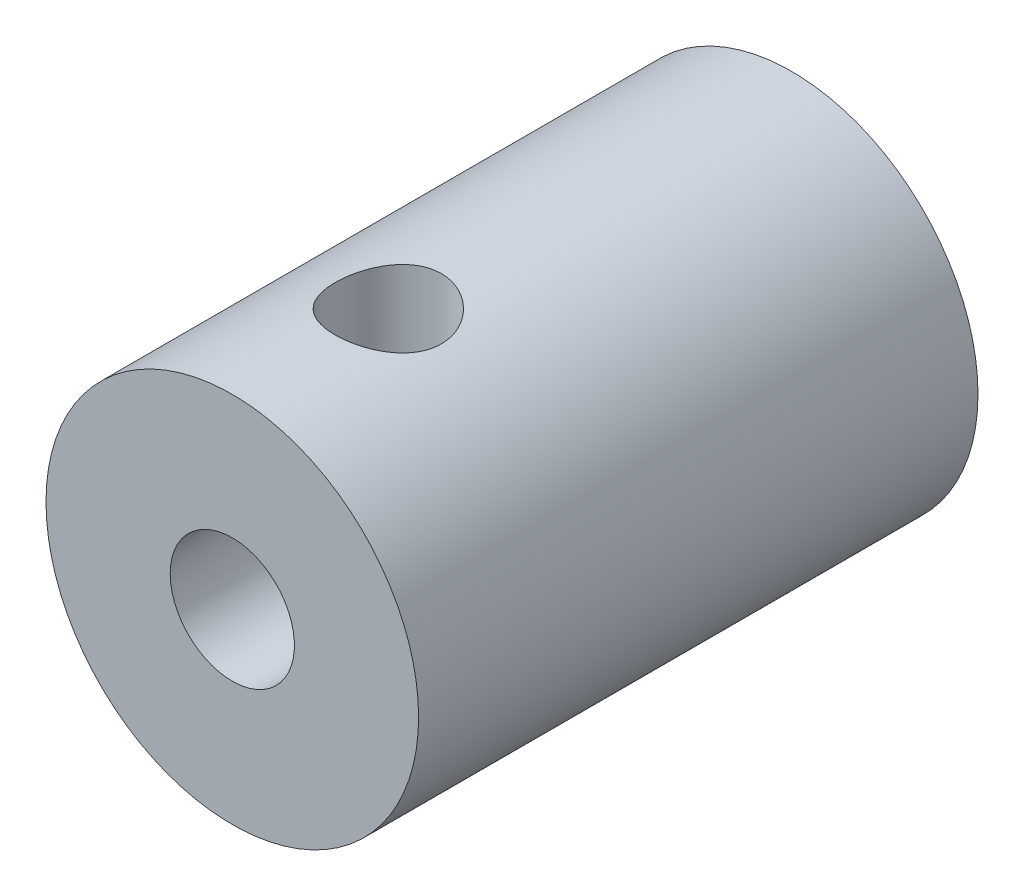
ISO-10303-21;
HEADER;
FILE_DESCRIPTION(('STEP AP214'),'2;1');
FILE_NAME('part.step','',(''),(''),'','','');
FILE_SCHEMA(('AUTOMOTIVE_DESIGN { 1 0 10303 214 1 1 1 1 }'));
ENDSEC;
DATA;
#1=APPLICATION_CONTEXT('core data for automotive mechanical design processes');
#2=APPLICATION_PROTOCOL_DEFINITION('international standard','automotive_design',2000,#1);
#3=PRODUCT_CONTEXT('',#1,'mechanical');
#4=PRODUCT('Part','Part','',(#3));
#5=PRODUCT_RELATED_PRODUCT_CATEGORY('part','',(#4));
#6=PRODUCT_DEFINITION_FORMATION('','',#4);
#7=PRODUCT_DEFINITION_CONTEXT('part definition',#1,'design');
#8=PRODUCT_DEFINITION('design','',#6,#7);
#9=PRODUCT_DEFINITION_SHAPE('','',#8);
#10=(LENGTH_UNIT() NAMED_UNIT(*) SI_UNIT(.MILLI.,.METRE.));
#11=(NAMED_UNIT(*) PLANE_ANGLE_UNIT() SI_UNIT($,.RADIAN.));
#12=(NAMED_UNIT(*) SI_UNIT($,.STERADIAN.) SOLID_ANGLE_UNIT());
#13=UNCERTAINTY_MEASURE_WITH_UNIT(LENGTH_MEASURE(1.E-05),#10,'distance_accuracy_value','');
#14=(GEOMETRIC_REPRESENTATION_CONTEXT(3) GLOBAL_UNCERTAINTY_ASSIGNED_CONTEXT((#13)) GLOBAL_UNIT_ASSIGNED_CONTEXT((#10,
#11,#12)) REPRESENTATION_CONTEXT('',''));
#15=CARTESIAN_POINT('',(0.,0.,0.));
#16=DIRECTION('',(0.,0.,1.));
#17=DIRECTION('',(1.,0.,0.));
#18=AXIS2_PLACEMENT_3D('',#15,#16,#17);
#19=CARTESIAN_POINT('',(0.,0.,14.3002));
#20=DIRECTION('',(0.,0.,-1.));
#21=DIRECTION('',(-1.,0.,0.));
#22=AXIS2_PLACEMENT_3D('',#19,#20,#21);
#23=CYLINDRICAL_SURFACE('',#22,1.5875);
#24=CARTESIAN_POINT('',(0.,-1.5875,11.6713));
#25=CARTESIAN_POINT('',(-0.0640084504905558,-1.58749589459133,11.6712958127309));
#26=CARTESIAN_POINT('',(-0.128052378170848,-1.58359361221242,11.6667427239407));
#27=CARTESIAN_POINT('',(-0.254004444384052,-1.56833557661519,11.6488693187214));
#28=CARTESIAN_POINT('',(-0.31591034239439,-1.55697224007382,11.6355400822862));
#29=CARTESIAN_POINT('',(-0.43545788852067,-1.52784070258027,11.6011333320459));
#30=CARTESIAN_POINT('',(-0.493123421246892,-1.51011232303287,11.5801039763453));
#31=CARTESIAN_POINT('',(-0.603563016370308,-1.46946883255929,11.5314038275147));
#32=CARTESIAN_POINT('',(-0.65633553057509,-1.44655208783111,11.5037309421891));
#33=CARTESIAN_POINT('',(-0.775479643972469,-1.38734547457949,11.431228393187));
#34=CARTESIAN_POINT('',(-0.839430121361419,-1.34927820132004,11.3838705313084));
#35=CARTESIAN_POINT('',(-0.956827927030479,-1.26875200121344,11.2805112899162));
#36=CARTESIAN_POINT('',(-1.01024616623841,-1.22628139243691,11.2244867137964));
#37=CARTESIAN_POINT('',(-1.10756916055087,-1.13919610828915,11.1036329469231));
#38=CARTESIAN_POINT('',(-1.15125855043728,-1.09455540189057,11.038647982042));
#39=CARTESIAN_POINT('',(-1.20839293207449,-1.02994020129173,10.9352453305035));
#40=CARTESIAN_POINT('',(-1.22602936162688,-1.00880526960526,10.8998142641661));
#41=CARTESIAN_POINT('',(-1.25840811877496,-0.968110362824358,10.8268057058711));
#42=CARTESIAN_POINT('',(-1.27315278956988,-0.948549120210561,10.7892299838775));
#43=CARTESIAN_POINT('',(-1.30030535020041,-0.911004554982558,10.7095011315517));
#44=CARTESIAN_POINT('',(-1.31252904950507,-0.893177658887615,10.6672089693406));
#45=CARTESIAN_POINT('',(-1.3330336869221,-0.862277496051067,10.5800335348547));
#46=CARTESIAN_POINT('',(-1.34132279892616,-0.849194387826297,10.5351558534305));
#47=CARTESIAN_POINT('',(-1.35346399193291,-0.829718778233447,10.4425763800295));
#48=CARTESIAN_POINT('',(-1.35724831461928,-0.823428578671972,10.3948425336665));
#49=CARTESIAN_POINT('',(-1.35967715414612,-0.819416815431586,10.2988983855038));
#50=CARTESIAN_POINT('',(-1.35832678712271,-0.821686722558324,10.2506886056781));
#51=CARTESIAN_POINT('',(-1.3512739801,-0.833213054748677,10.1630454067824));
#52=CARTESIAN_POINT('',(-1.34626586930141,-0.841352481635303,10.1233938189834));
#53=CARTESIAN_POINT('',(-1.3330747561935,-0.862102484627274,10.0458069526178));
#54=CARTESIAN_POINT('',(-1.32488626617737,-0.874720785718706,10.007874767888));
#55=CARTESIAN_POINT('',(-1.29777622467968,-0.91481806217253,9.90342216849849));
#56=CARTESIAN_POINT('',(-1.27557728239548,-0.945959990673267,9.8391840292266));
#57=CARTESIAN_POINT('',(-1.22317046070292,-1.01283679367527,9.7166460783179));
#58=CARTESIAN_POINT('',(-1.19293820130944,-1.04858547600138,9.65836510420953));
#59=CARTESIAN_POINT('',(-1.12216109506704,-1.12419073896514,9.54278538980588));
#60=CARTESIAN_POINT('',(-1.08098529702561,-1.16414732702571,9.48593715593545));
#61=CARTESIAN_POINT('',(-0.989845756287439,-1.2425690540304,9.37872205247443));
#62=CARTESIAN_POINT('',(-0.939892243937295,-1.28103586628618,9.3283477546308));
#63=CARTESIAN_POINT('',(-0.834150799346787,-1.35210097812726,9.23751445515691));
#64=CARTESIAN_POINT('',(-0.778849609273434,-1.38490773733558,9.19665692022532));
#65=CARTESIAN_POINT('',(-0.660526806227747,-1.44507822711164,9.12279442899352));
#66=CARTESIAN_POINT('',(-0.597512689657164,-1.47244717600585,9.08978193827052));
#67=CARTESIAN_POINT('',(-0.476303309747889,-1.5154778394623,9.03831708605576));
#68=CARTESIAN_POINT('',(-0.419195857618796,-1.53235030667584,9.01832748246568));
#69=CARTESIAN_POINT('',(-0.301411762969124,-1.55979290959103,8.98594556501144));
#70=CARTESIAN_POINT('',(-0.240737764634567,-1.57036765117261,8.97354769869642));
#71=CARTESIAN_POINT('',(-0.117156057800018,-1.58439653382545,8.95711999102989));
#72=CARTESIAN_POINT('',(-0.0542395964092401,-1.58781871755521,8.95312770489127));
#73=CARTESIAN_POINT('',(0.0714976367282692,-1.58713437817949,8.95392708996004));
#74=CARTESIAN_POINT('',(0.134318410856156,-1.58302804558713,8.95871853889035));
#75=CARTESIAN_POINT('',(0.253393528607964,-1.56821346156491,8.97607493754793));
#76=CARTESIAN_POINT('',(0.309796808389616,-1.55799646830022,8.98806167137502));
#77=CARTESIAN_POINT('',(0.419460262510755,-1.53211827479266,9.01860522171979));
#78=CARTESIAN_POINT('',(0.472719944416459,-1.51645622423393,9.03716306440915));
#79=CARTESIAN_POINT('',(0.579486540550051,-1.47912502022405,9.08177981424115));
#80=CARTESIAN_POINT('',(0.632647717425507,-1.45706543034463,9.108333131018));
#81=CARTESIAN_POINT('',(0.733720870068728,-1.4088832597255,9.16711084410029));
#82=CARTESIAN_POINT('',(0.781628630163251,-1.38275745608468,9.19933974158627));
#83=CARTESIAN_POINT('',(0.894720285326069,-1.31375589481025,9.28604087051777));
#84=CARTESIAN_POINT('',(0.956477460615478,-1.26906359315812,9.34354877195222));
#85=CARTESIAN_POINT('',(1.0677494630227,-1.17698022010064,9.4677070934192));
#86=CARTESIAN_POINT('',(1.11723724811169,-1.1295834657236,9.53437721363313));
#87=CARTESIAN_POINT('',(1.19351749671388,-1.04786085051356,9.65960358984201));
#88=CARTESIAN_POINT('',(1.22290828097926,-1.01310863453805,9.71631504139277));
#89=CARTESIAN_POINT('',(1.27406536320765,-0.947949175840945,9.83537755047493));
#90=CARTESIAN_POINT('',(1.29585426247341,-0.917529215212046,9.89771118491842));
#91=CARTESIAN_POINT('',(1.32402059627502,-0.87607254910584,10.0036477947715));
#92=CARTESIAN_POINT('',(1.33310694240689,-0.862066481648083,10.0453397515935));
#93=CARTESIAN_POINT('',(1.3474026932412,-0.839548365865379,10.1307900240933));
#94=CARTESIAN_POINT('',(1.35262202963345,-0.831022250833542,10.1745427372041));
#95=CARTESIAN_POINT('',(1.35876313025869,-0.820951006491957,10.2636362550801));
#96=CARTESIAN_POINT('',(1.35964220113738,-0.819475232969577,10.3089884337188));
#97=CARTESIAN_POINT('',(1.35687863818691,-0.824039148789004,10.3991865057367));
#98=CARTESIAN_POINT('',(1.35323144607264,-0.83008641440837,10.4440318427637));
#99=CARTESIAN_POINT('',(1.34067637600014,-0.850237335459248,10.5404566560591));
#100=CARTESIAN_POINT('',(1.33087333584442,-0.865693932124668,10.5916213509243));
#101=CARTESIAN_POINT('',(1.30622154024598,-0.902456395548841,10.6905731795525));
#102=CARTESIAN_POINT('',(1.29135486175709,-0.923782987325061,10.7383475771669));
#103=CARTESIAN_POINT('',(1.26002710676671,-0.96595144753542,10.8229106889895));
#104=CARTESIAN_POINT('',(1.24423605751177,-0.986290454008599,10.860209756448));
#105=CARTESIAN_POINT('',(1.20974843424541,-1.02830258738565,10.932664280368));
#106=CARTESIAN_POINT('',(1.19105003626277,-1.04997654660314,10.9678183717342));
#107=CARTESIAN_POINT('',(1.13069673840227,-1.11589279748126,11.07031686126));
#108=CARTESIAN_POINT('',(1.08479820919116,-1.16100863868931,11.1346592807031));
#109=CARTESIAN_POINT('',(0.97943587426016,-1.25137093830487,11.2580173213044));
#110=CARTESIAN_POINT('',(0.919440875611505,-1.29652607090841,11.3166465455703));
#111=CARTESIAN_POINT('',(0.787143942101332,-1.38082214260056,11.4233379251849));
#112=CARTESIAN_POINT('',(0.714877805812195,-1.41997996297702,11.4714299117493));
#113=CARTESIAN_POINT('',(0.583235904430114,-1.47764390080102,11.5412760035947));
#114=CARTESIAN_POINT('',(0.526881409566862,-1.49878058294293,11.5665651021109));
#115=CARTESIAN_POINT('',(0.409550647271624,-1.53498276788059,11.6096133296628));
#116=CARTESIAN_POINT('',(0.348582333889017,-1.5500584485316,11.627385084735));
#117=CARTESIAN_POINT('',(0.239567673912469,-1.57003245311106,11.6508623260936));
#118=CARTESIAN_POINT('',(0.192224956350628,-1.57655031756783,11.6584946667913));
#119=CARTESIAN_POINT('',(0.0965949608552555,-1.58528586659189,11.6687153493739));
#120=CARTESIAN_POINT('',(0.0483075840061865,-1.58750309837799,11.6713031601585));
#121=CARTESIAN_POINT('',(0.,-1.5875,11.6713));
#122=B_SPLINE_CURVE_WITH_KNOTS('',3,(#24,#25,#26,#27,#28,#29,#30,#31,#32,#33,#34,#35,#36,#37,
#38,#39,#40,#41,#42,#43,#44,#45,#46,#47,#48,#49,#50,#51,#52,#53,#54,#55,#56,#57,#58,#59,#60,#61,
#62,#63,#64,#65,#66,#67,#68,#69,#70,#71,#72,#73,#74,#75,#76,#77,#78,#79,#80,#81,#82,#83,#84,#85,
#86,#87,#88,#89,#90,#91,#92,#93,#94,#95,#96,#97,#98,#99,#100,#101,#102,#103,#104,#105,#106,#107,
#108,#109,#110,#111,#112,#113,#114,#115,#116,#117,#118,#119,#120,#121),.UNSPECIFIED.,.T.,.F.,(4,
2,2,2,2,2,2,2,2,2,2,2,2,2,2,2,2,2,2,2,2,2,2,2,2,2,2,2,2,2,2,2,2,2,2,2,2,2,2,2,2,2,2,2,2,2,2,2,
4),(0.,0.191819070193151,0.383833405340433,0.574666802483425,0.76556037633045,1.02876556970795,
1.29268783032967,1.56197287161722,1.69644721660348,1.83081214236432,1.97293887195886,
2.11476903455327,2.25870660067517,2.40250078693054,2.52438949382207,2.64648945934396,
2.86950106145086,3.09319735934307,3.33476611409664,3.57605516781693,3.80376118121025,
4.03124761261003,4.21890672322055,4.40642841911626,4.59478617885752,4.78313917217131,
4.95807134920853,5.13303085643881,5.32249879781938,5.51211768446107,5.79708739754358,
6.08267971605064,6.30030781167958,6.51728324622822,6.65159868143531,6.78556794531423,
6.92085241842386,7.05627324373468,7.2183844025825,7.38107543147492,7.51686726565472,
7.6527446373059,7.92463540426726,8.2091589064312,8.49286619739085,8.68798293153917,
8.88277063611259,9.02752246733836,9.17228953756625),.UNSPECIFIED.);
#123=CARTESIAN_POINT('',(0.,-1.5875,11.6713));
#124=VERTEX_POINT('',#123);
#125=EDGE_CURVE('E76',#124,#124,#122,.T.);
#126=ORIENTED_EDGE('',*,*,#125,.T.);
#127=EDGE_LOOP('',(#126));
#128=FACE_BOUND('',#127,.T.);
#129=CARTESIAN_POINT('',(0.,1.5875,11.6713));
#130=CARTESIAN_POINT('',(0.0640084504905558,1.58749589459133,11.6712958127309));
#131=CARTESIAN_POINT('',(0.128052378170848,1.58359361221242,11.6667427239407));
#132=CARTESIAN_POINT('',(0.254004444384052,1.56833557661519,11.6488693187214));
#133=CARTESIAN_POINT('',(0.31591034239439,1.55697224007382,11.6355400822862));
#134=CARTESIAN_POINT('',(0.43545788852067,1.52784070258027,11.6011333320459));
#135=CARTESIAN_POINT('',(0.493123421246892,1.51011232303287,11.5801039763453));
#136=CARTESIAN_POINT('',(0.603563016370308,1.46946883255929,11.5314038275147));
#137=CARTESIAN_POINT('',(0.65633553057509,1.44655208783111,11.5037309421891));
#138=CARTESIAN_POINT('',(0.775479643972469,1.38734547457949,11.431228393187));
#139=CARTESIAN_POINT('',(0.839430121361419,1.34927820132004,11.3838705313084));
#140=CARTESIAN_POINT('',(0.956827927030479,1.26875200121344,11.2805112899162));
#141=CARTESIAN_POINT('',(1.01024616623841,1.22628139243691,11.2244867137964));
#142=CARTESIAN_POINT('',(1.10756916055087,1.13919610828915,11.1036329469231));
#143=CARTESIAN_POINT('',(1.15125855043728,1.09455540189057,11.038647982042));
#144=CARTESIAN_POINT('',(1.20839293207449,1.02994020129173,10.9352453305035));
#145=CARTESIAN_POINT('',(1.22602936162688,1.00880526960526,10.8998142641661));
#146=CARTESIAN_POINT('',(1.25840811877496,0.968110362824358,10.8268057058711));
#147=CARTESIAN_POINT('',(1.27315278956988,0.948549120210561,10.7892299838775));
#148=CARTESIAN_POINT('',(1.30030535020041,0.911004554982558,10.7095011315517));
#149=CARTESIAN_POINT('',(1.31252904950507,0.893177658887615,10.6672089693406));
#150=CARTESIAN_POINT('',(1.3330336869221,0.862277496051067,10.5800335348547));
#151=CARTESIAN_POINT('',(1.34132279892616,0.849194387826297,10.5351558534305));
#152=CARTESIAN_POINT('',(1.35346399193291,0.829718778233447,10.4425763800295));
#153=CARTESIAN_POINT('',(1.35724831461928,0.823428578671972,10.3948425336665));
#154=CARTESIAN_POINT('',(1.35967715414612,0.819416815431586,10.2988983855038));
#155=CARTESIAN_POINT('',(1.35832678712271,0.821686722558324,10.2506886056781));
#156=CARTESIAN_POINT('',(1.3512739801,0.833213054748677,10.1630454067824));
#157=CARTESIAN_POINT('',(1.34626586930141,0.841352481635303,10.1233938189834));
#158=CARTESIAN_POINT('',(1.3330747561935,0.862102484627274,10.0458069526178));
#159=CARTESIAN_POINT('',(1.32488626617737,0.874720785718706,10.007874767888));
#160=CARTESIAN_POINT('',(1.29777622467968,0.91481806217253,9.90342216849849));
#161=CARTESIAN_POINT('',(1.27557728239548,0.945959990673267,9.8391840292266));
#162=CARTESIAN_POINT('',(1.22317046070292,1.01283679367527,9.7166460783179));
#163=CARTESIAN_POINT('',(1.19293820130944,1.04858547600138,9.65836510420953));
#164=CARTESIAN_POINT('',(1.12216109506704,1.12419073896514,9.54278538980588));
#165=CARTESIAN_POINT('',(1.08098529702561,1.16414732702571,9.48593715593545));
#166=CARTESIAN_POINT('',(0.989845756287439,1.2425690540304,9.37872205247443));
#167=CARTESIAN_POINT('',(0.939892243937295,1.28103586628618,9.3283477546308));
#168=CARTESIAN_POINT('',(0.834150799346787,1.35210097812726,9.23751445515691));
#169=CARTESIAN_POINT('',(0.778849609273434,1.38490773733558,9.19665692022532));
#170=CARTESIAN_POINT('',(0.660526806227747,1.44507822711164,9.12279442899352));
#171=CARTESIAN_POINT('',(0.597512689657164,1.47244717600585,9.08978193827052));
#172=CARTESIAN_POINT('',(0.476303309747889,1.5154778394623,9.03831708605576));
#173=CARTESIAN_POINT('',(0.419195857618796,1.53235030667584,9.01832748246568));
#174=CARTESIAN_POINT('',(0.301411762969124,1.55979290959103,8.98594556501144));
#175=CARTESIAN_POINT('',(0.240737764634567,1.57036765117261,8.97354769869642));
#176=CARTESIAN_POINT('',(0.117156057800018,1.58439653382545,8.95711999102989));
#177=CARTESIAN_POINT('',(0.0542395964092401,1.58781871755521,8.95312770489127));
#178=CARTESIAN_POINT('',(-0.0714976367282692,1.58713437817949,8.95392708996004));
#179=CARTESIAN_POINT('',(-0.134318410856156,1.58302804558713,8.95871853889035));
#180=CARTESIAN_POINT('',(-0.253393528607964,1.56821346156491,8.97607493754793));
#181=CARTESIAN_POINT('',(-0.309796808389616,1.55799646830022,8.98806167137502));
#182=CARTESIAN_POINT('',(-0.419460262510755,1.53211827479266,9.01860522171979));
#183=CARTESIAN_POINT('',(-0.472719944416459,1.51645622423393,9.03716306440915));
#184=CARTESIAN_POINT('',(-0.579486540550051,1.47912502022405,9.08177981424115));
#185=CARTESIAN_POINT('',(-0.632647717425507,1.45706543034463,9.108333131018));
#186=CARTESIAN_POINT('',(-0.733720870068728,1.4088832597255,9.16711084410029));
#187=CARTESIAN_POINT('',(-0.781628630163251,1.38275745608468,9.19933974158627));
#188=CARTESIAN_POINT('',(-0.894720285326069,1.31375589481025,9.28604087051777));
#189=CARTESIAN_POINT('',(-0.956477460615478,1.26906359315812,9.34354877195222));
#190=CARTESIAN_POINT('',(-1.0677494630227,1.17698022010064,9.4677070934192));
#191=CARTESIAN_POINT('',(-1.11723724811169,1.1295834657236,9.53437721363313));
#192=CARTESIAN_POINT('',(-1.19351749671388,1.04786085051356,9.65960358984201));
#193=CARTESIAN_POINT('',(-1.22290828097926,1.01310863453805,9.71631504139277));
#194=CARTESIAN_POINT('',(-1.27406536320765,0.947949175840945,9.83537755047493));
#195=CARTESIAN_POINT('',(-1.29585426247341,0.917529215212046,9.89771118491842));
#196=CARTESIAN_POINT('',(-1.32402059627502,0.87607254910584,10.0036477947715));
#197=CARTESIAN_POINT('',(-1.33310694240689,0.862066481648083,10.0453397515935));
#198=CARTESIAN_POINT('',(-1.3474026932412,0.839548365865379,10.1307900240933));
#199=CARTESIAN_POINT('',(-1.35262202963345,0.831022250833542,10.1745427372041));
#200=CARTESIAN_POINT('',(-1.35876313025869,0.820951006491957,10.2636362550801));
#201=CARTESIAN_POINT('',(-1.35964220113738,0.819475232969577,10.3089884337188));
#202=CARTESIAN_POINT('',(-1.35687863818691,0.824039148789004,10.3991865057367));
#203=CARTESIAN_POINT('',(-1.35323144607264,0.83008641440837,10.4440318427637));
#204=CARTESIAN_POINT('',(-1.34067637600014,0.850237335459248,10.5404566560591));
#205=CARTESIAN_POINT('',(-1.33087333584442,0.865693932124668,10.5916213509243));
#206=CARTESIAN_POINT('',(-1.30622154024598,0.902456395548841,10.6905731795525));
#207=CARTESIAN_POINT('',(-1.29135486175709,0.923782987325061,10.7383475771669));
#208=CARTESIAN_POINT('',(-1.26002710676671,0.96595144753542,10.8229106889895));
#209=CARTESIAN_POINT('',(-1.24423605751177,0.986290454008599,10.860209756448));
#210=CARTESIAN_POINT('',(-1.20974843424541,1.02830258738565,10.932664280368));
#211=CARTESIAN_POINT('',(-1.19105003626277,1.04997654660314,10.9678183717342));
#212=CARTESIAN_POINT('',(-1.13069673840227,1.11589279748126,11.07031686126));
#213=CARTESIAN_POINT('',(-1.08479820919116,1.16100863868931,11.1346592807031));
#214=CARTESIAN_POINT('',(-0.97943587426016,1.25137093830487,11.2580173213044));
#215=CARTESIAN_POINT('',(-0.919440875611505,1.29652607090841,11.3166465455703));
#216=CARTESIAN_POINT('',(-0.787143942101332,1.38082214260056,11.4233379251849));
#217=CARTESIAN_POINT('',(-0.714877805812195,1.41997996297702,11.4714299117493));
#218=CARTESIAN_POINT('',(-0.583235904430114,1.47764390080102,11.5412760035947));
#219=CARTESIAN_POINT('',(-0.526881409566862,1.49878058294293,11.5665651021109));
#220=CARTESIAN_POINT('',(-0.409550647271624,1.53498276788059,11.6096133296628));
#221=CARTESIAN_POINT('',(-0.348582333889017,1.5500584485316,11.627385084735));
#222=CARTESIAN_POINT('',(-0.239567673912469,1.57003245311106,11.6508623260936));
#223=CARTESIAN_POINT('',(-0.192224956350628,1.57655031756783,11.6584946667913));
#224=CARTESIAN_POINT('',(-0.0965949608552555,1.58528586659189,11.6687153493739));
#225=CARTESIAN_POINT('',(-0.0483075840061865,1.58750309837799,11.6713031601585));
#226=CARTESIAN_POINT('',(0.,1.5875,11.6713));
#227=B_SPLINE_CURVE_WITH_KNOTS('',3,(#129,#130,#131,#132,#133,#134,#135,#136,#137,#138,#139,
#140,#141,#142,#143,#144,#145,#146,#147,#148,#149,#150,#151,#152,#153,#154,#155,#156,#157,#158,
#159,#160,#161,#162,#163,#164,#165,#166,#167,#168,#169,#170,#171,#172,#173,#174,#175,#176,#177,
#178,#179,#180,#181,#182,#183,#184,#185,#186,#187,#188,#189,#190,#191,#192,#193,#194,#195,#196,
#197,#198,#199,#200,#201,#202,#203,#204,#205,#206,#207,#208,#209,#210,#211,#212,#213,#214,#215,
#216,#217,#218,#219,#220,#221,#222,#223,#224,#225,#226),.UNSPECIFIED.,.T.,.F.,(4,2,2,2,2,2,2,2,
2,2,2,2,2,2,2,2,2,2,2,2,2,2,2,2,2,2,2,2,2,2,2,2,2,2,2,2,2,2,2,2,2,2,2,2,2,2,2,2,4),(0.,
0.191819070193151,0.383833405340433,0.574666802483425,0.76556037633045,1.02876556970795,
1.29268783032967,1.56197287161722,1.69644721660348,1.83081214236432,1.97293887195886,
2.11476903455327,2.25870660067517,2.40250078693054,2.52438949382207,2.64648945934396,
2.86950106145086,3.09319735934307,3.33476611409664,3.57605516781693,3.80376118121025,
4.03124761261003,4.21890672322055,4.40642841911626,4.59478617885752,4.78313917217131,
4.95807134920853,5.13303085643881,5.32249879781938,5.51211768446107,5.79708739754358,
6.08267971605064,6.30030781167958,6.51728324622822,6.65159868143531,6.78556794531423,
6.92085241842386,7.05627324373468,7.2183844025825,7.38107543147492,7.51686726565472,
7.6527446373059,7.92463540426726,8.2091589064312,8.49286619739085,8.68798293153917,
8.88277063611259,9.02752246733836,9.17228953756625),.UNSPECIFIED.);
#228=CARTESIAN_POINT('',(0.,1.5875,11.6713));
#229=VERTEX_POINT('',#228);
#230=EDGE_CURVE('E70',#229,#229,#227,.T.);
#231=ORIENTED_EDGE('',*,*,#230,.T.);
#232=EDGE_LOOP('',(#231));
#233=FACE_BOUND('',#232,.T.);
#234=CARTESIAN_POINT('',(0.,0.,14.3002));
#235=DIRECTION('',(0.,0.,-1.));
#236=DIRECTION('',(-1.,0.,0.));
#237=AXIS2_PLACEMENT_3D('',#234,#235,#236);
#238=CIRCLE('',#237,1.5875);
#239=CARTESIAN_POINT('',(-1.5875,0.,14.3002));
#240=VERTEX_POINT('',#239);
#241=EDGE_CURVE('E104',#240,#240,#238,.T.);
#242=ORIENTED_EDGE('',*,*,#241,.F.);
#243=EDGE_LOOP('',(#242));
#244=FACE_BOUND('',#243,.T.);
#245=CARTESIAN_POINT('',(0.,0.,6.35));
#246=DIRECTION('',(0.,0.,-1.));
#247=DIRECTION('',(-1.,0.,0.));
#248=AXIS2_PLACEMENT_3D('',#245,#246,#247);
#249=CIRCLE('',#248,1.5875);
#250=CARTESIAN_POINT('',(-1.5875,0.,6.35));
#251=VERTEX_POINT('',#250);
#252=EDGE_CURVE('E110',#251,#251,#249,.T.);
#253=ORIENTED_EDGE('',*,*,#252,.T.);
#254=EDGE_LOOP('',(#253));
#255=FACE_BOUND('',#254,.T.);
#256=ADVANCED_FACE('F31',(#128,#233,#244,#255),#23,.F.);
#257=CARTESIAN_POINT('',(0.,0.,14.3002));
#258=DIRECTION('',(0.,0.,-1.));
#259=DIRECTION('',(-1.,0.,0.));
#260=AXIS2_PLACEMENT_3D('',#257,#258,#259);
#261=CYLINDRICAL_SURFACE('',#260,4.7625);
#262=CARTESIAN_POINT('',(0.,-4.7625,11.6713));
#263=CARTESIAN_POINT('',(0.0747130529778893,-4.76249910615411,11.671298671976));
#264=CARTESIAN_POINT('',(0.149439770560647,-4.76072484176044,11.6651178104309));
#265=CARTESIAN_POINT('',(0.29672763904972,-4.75381979521839,11.6406095451125));
#266=CARTESIAN_POINT('',(0.369287954910806,-4.74868773582743,11.6222775192282));
#267=CARTESIAN_POINT('',(0.510096647559026,-4.73563130773512,11.5741211216186));
#268=CARTESIAN_POINT('',(0.578350873706299,-4.72771082749983,11.5443127483235));
#269=CARTESIAN_POINT('',(0.708892135043702,-4.70990700954045,11.474112593486));
#270=CARTESIAN_POINT('',(0.771178549527406,-4.70002346796803,11.4337197126874));
#271=CARTESIAN_POINT('',(0.889649651730131,-4.67906373955544,11.3423797925316));
#272=CARTESIAN_POINT('',(0.945655610055491,-4.66796490800477,11.2912061362912));
#273=CARTESIAN_POINT('',(1.0484184909622,-4.64596516914378,11.1802409117405));
#274=CARTESIAN_POINT('',(1.09517403095885,-4.63506429164082,11.120448057494));
#275=CARTESIAN_POINT('',(1.17901776862754,-4.61445881113563,10.9924684439848));
#276=CARTESIAN_POINT('',(1.21589352500811,-4.60478254947106,10.9241375198113));
#277=CARTESIAN_POINT('',(1.27755991315349,-4.5880578689383,10.7819241474718));
#278=CARTESIAN_POINT('',(1.30235313696768,-4.58100888651983,10.7080428939391));
#279=CARTESIAN_POINT('',(1.33851692730094,-4.57057187087897,10.5588210575646));
#280=CARTESIAN_POINT('',(1.35021458589323,-4.56709481286359,10.4835661318741));
#281=CARTESIAN_POINT('',(1.36087589799455,-4.56392995914291,10.3320878156901));
#282=CARTESIAN_POINT('',(1.35984231028366,-4.56424134250628,10.2558646385866));
#283=CARTESIAN_POINT('',(1.34532862879658,-4.56853893279477,10.1072239317419));
#284=CARTESIAN_POINT('',(1.33225183347416,-4.57240605959699,10.0347630201825));
#285=CARTESIAN_POINT('',(1.29467196470204,-4.58318766064072,9.89310929430149));
#286=CARTESIAN_POINT('',(1.27016786074857,-4.59010240971079,9.82391677534031));
#287=CARTESIAN_POINT('',(1.21011778079943,-4.60629950381668,9.68974828380762));
#288=CARTESIAN_POINT('',(1.17443624887876,-4.6156106498115,9.62483660696924));
#289=CARTESIAN_POINT('',(1.09313853115981,-4.63553682583539,9.50178401189799));
#290=CARTESIAN_POINT('',(1.04752013887183,-4.64615214522885,9.44364460186131));
#291=CARTESIAN_POINT('',(0.945613808374621,-4.66797933994029,9.33349161037857));
#292=CARTESIAN_POINT('',(0.888989324200014,-4.67919864201871,9.28179035879976));
#293=CARTESIAN_POINT('',(0.767734854711599,-4.70061425563702,9.18854872602479));
#294=CARTESIAN_POINT('',(0.703104456973554,-4.71081051442586,9.14700886862053));
#295=CARTESIAN_POINT('',(0.567143378034055,-4.72910979837591,9.075103586628));
#296=CARTESIAN_POINT('',(0.495777409782721,-4.7372008583588,9.04480163718408));
#297=CARTESIAN_POINT('',(0.348679021038379,-4.75029187375806,8.99671940415858));
#298=CARTESIAN_POINT('',(0.27294770327371,-4.75529260611158,8.97893597314828));
#299=CARTESIAN_POINT('',(0.121928159085002,-4.7615190609649,8.95690209326221));
#300=CARTESIAN_POINT('',(0.0467065564677244,-4.76286298156602,8.95222776374153));
#301=CARTESIAN_POINT('',(-0.103448322015912,-4.76196800761694,8.95536462321627));
#302=CARTESIAN_POINT('',(-0.178381631303093,-4.7597295417235,8.96317431841361));
#303=CARTESIAN_POINT('',(-0.324272411558481,-4.75199826556877,8.99071236754281));
#304=CARTESIAN_POINT('',(-0.395279512238859,-4.74657173442845,9.01019813863549));
#305=CARTESIAN_POINT('',(-0.533005492039659,-4.73308606280186,9.06024797216756));
#306=CARTESIAN_POINT('',(-0.599723874762198,-4.72502661822315,9.09081331430395));
#307=CARTESIAN_POINT('',(-0.72857800326758,-4.70690007925331,9.16289970410737));
#308=CARTESIAN_POINT('',(-0.790583580364398,-4.69679336748189,9.20464320620641));
#309=CARTESIAN_POINT('',(-0.906856321261831,-4.67573685565677,9.29762655338169));
#310=CARTESIAN_POINT('',(-0.96112172450521,-4.66478686466267,9.34886855288264));
#311=CARTESIAN_POINT('',(-1.06220467816608,-4.64283250450958,9.46138111638906));
#312=CARTESIAN_POINT('',(-1.10872158995048,-4.63183800989465,9.52292425561314));
#313=CARTESIAN_POINT('',(-1.19078217067452,-4.61142480451941,9.65318002238218));
#314=CARTESIAN_POINT('',(-1.22632622343521,-4.60200603864677,9.72189239904095));
#315=CARTESIAN_POINT('',(-1.28517268145781,-4.58592072488041,9.86424967682684));
#316=CARTESIAN_POINT('',(-1.30854012713244,-4.5792395959238,9.93786595207722));
#317=CARTESIAN_POINT('',(-1.34249121008744,-4.56940281032297,10.0882106631389));
#318=CARTESIAN_POINT('',(-1.35307870810188,-4.56624608900115,10.164938151831));
#319=CARTESIAN_POINT('',(-1.36092455040578,-4.56391335454089,10.3162252824675));
#320=CARTESIAN_POINT('',(-1.35866970788407,-4.56459194886419,10.3907577870737));
#321=CARTESIAN_POINT('',(-1.3420420529431,-4.5695079526439,10.5383329044818));
#322=CARTESIAN_POINT('',(-1.32766964286741,-4.5737452439397,10.611375566669));
#323=CARTESIAN_POINT('',(-1.28751515000952,-4.58520849858504,10.7531851097254));
#324=CARTESIAN_POINT('',(-1.26185029178566,-4.59240370727278,10.821987849387));
#325=CARTESIAN_POINT('',(-1.19993011119005,-4.60896913868397,10.9543650535867));
#326=CARTESIAN_POINT('',(-1.16367291868063,-4.61833974542644,11.0179385923371));
#327=CARTESIAN_POINT('',(-1.0801812993991,-4.63858981495493,11.1403414263751));
#328=CARTESIAN_POINT('',(-1.03262149419702,-4.64950913599081,11.1989421984965));
#329=CARTESIAN_POINT('',(-0.928475317194594,-4.67142023258268,11.3074890451587));
#330=CARTESIAN_POINT('',(-0.871886677332633,-4.6824120256769,11.3574329384794));
#331=CARTESIAN_POINT('',(-0.749545117737118,-4.70356613921108,11.4485134167292));
#332=CARTESIAN_POINT('',(-0.683594906488908,-4.71370007221688,11.4893922168012));
#333=CARTESIAN_POINT('',(-0.545468955126888,-4.73167059506192,11.559420751589));
#334=CARTESIAN_POINT('',(-0.473296655907666,-4.73950844425046,11.5885769191808));
#335=CARTESIAN_POINT('',(-0.334651372172606,-4.75116806432972,11.6311723440356));
#336=CARTESIAN_POINT('',(-0.26869022003419,-4.75538435031651,11.6461821693408));
#337=CARTESIAN_POINT('',(-0.135156295305952,-4.76105053847871,11.6662459359602));
#338=CARTESIAN_POINT('',(-0.0675837382544703,-4.76250080855278,11.6713012013004));
#339=CARTESIAN_POINT('',(0.,-4.7625,11.6713));
#340=B_SPLINE_CURVE_WITH_KNOTS('',3,(#262,#263,#264,#265,#266,#267,#268,#269,#270,#271,#272,
#273,#274,#275,#276,#277,#278,#279,#280,#281,#282,#283,#284,#285,#286,#287,#288,#289,#290,#291,
#292,#293,#294,#295,#296,#297,#298,#299,#300,#301,#302,#303,#304,#305,#306,#307,#308,#309,#310,
#311,#312,#313,#314,#315,#316,#317,#318,#319,#320,#321,#322,#323,#324,#325,#326,#327,#328,#329,
#330,#331,#332,#333,#334,#335,#336,#337,#338,#339),.UNSPECIFIED.,.T.,.F.,(4,2,2,2,2,2,2,2,2,2,2,
2,2,2,2,2,2,2,2,2,2,2,2,2,2,2,2,2,2,2,2,2,2,2,2,2,2,2,4),(0.,0.223891093401415,
0.447867400348589,0.671532600450735,0.895221038562008,1.1241894540172,1.3531920657071,
1.58678251369103,1.82032282774805,2.04788987982158,2.27540762043045,2.49557293839875,
2.71575811450561,2.93872435402094,3.16174015397321,3.39313717400732,3.62454611940855,
3.85724291462337,4.08988118386984,4.3149052647879,4.53990242206693,4.7603796636648,
4.98088237863229,5.20614959447116,5.4314679674992,5.66413515523558,5.89679420355433,
6.12819744276731,6.35953075914808,6.58215477179628,6.80477139287778,7.02512967857782,
7.24552689333998,7.47326441045602,7.70105922603058,7.93467729979019,8.16816699845995,
8.3707207616397,8.57324758193209),.UNSPECIFIED.);
#341=CARTESIAN_POINT('',(0.,-4.7625,11.6713));
#342=VERTEX_POINT('',#341);
#343=EDGE_CURVE('E10',#342,#342,#340,.T.);
#344=ORIENTED_EDGE('',*,*,#343,.T.);
#345=EDGE_LOOP('',(#344));
#346=FACE_BOUND('',#345,.T.);
#347=CARTESIAN_POINT('',(0.,4.7625,11.6713));
#348=CARTESIAN_POINT('',(-0.0747130529778893,4.76249910615411,11.671298671976));
#349=CARTESIAN_POINT('',(-0.149439770560647,4.76072484176044,11.6651178104309));
#350=CARTESIAN_POINT('',(-0.29672763904972,4.75381979521839,11.6406095451125));
#351=CARTESIAN_POINT('',(-0.369287954910806,4.74868773582743,11.6222775192282));
#352=CARTESIAN_POINT('',(-0.510096647559026,4.73563130773512,11.5741211216186));
#353=CARTESIAN_POINT('',(-0.578350873706299,4.72771082749983,11.5443127483235));
#354=CARTESIAN_POINT('',(-0.708892135043702,4.70990700954045,11.474112593486));
#355=CARTESIAN_POINT('',(-0.771178549527406,4.70002346796803,11.4337197126874));
#356=CARTESIAN_POINT('',(-0.889649651730131,4.67906373955544,11.3423797925316));
#357=CARTESIAN_POINT('',(-0.945655610055491,4.66796490800477,11.2912061362912));
#358=CARTESIAN_POINT('',(-1.0484184909622,4.64596516914378,11.1802409117405));
#359=CARTESIAN_POINT('',(-1.09517403095885,4.63506429164082,11.120448057494));
#360=CARTESIAN_POINT('',(-1.17901776862754,4.61445881113563,10.9924684439848));
#361=CARTESIAN_POINT('',(-1.21589352500811,4.60478254947106,10.9241375198113));
#362=CARTESIAN_POINT('',(-1.27755991315349,4.5880578689383,10.7819241474718));
#363=CARTESIAN_POINT('',(-1.30235313696768,4.58100888651983,10.7080428939391));
#364=CARTESIAN_POINT('',(-1.33851692730094,4.57057187087897,10.5588210575646));
#365=CARTESIAN_POINT('',(-1.35021458589323,4.56709481286359,10.4835661318741));
#366=CARTESIAN_POINT('',(-1.36087589799455,4.56392995914291,10.3320878156901));
#367=CARTESIAN_POINT('',(-1.35984231028366,4.56424134250628,10.2558646385866));
#368=CARTESIAN_POINT('',(-1.34532862879658,4.56853893279477,10.1072239317419));
#369=CARTESIAN_POINT('',(-1.33225183347416,4.57240605959699,10.0347630201825));
#370=CARTESIAN_POINT('',(-1.29467196470204,4.58318766064072,9.89310929430149));
#371=CARTESIAN_POINT('',(-1.27016786074857,4.59010240971079,9.82391677534031));
#372=CARTESIAN_POINT('',(-1.21011778079943,4.60629950381668,9.68974828380762));
#373=CARTESIAN_POINT('',(-1.17443624887876,4.6156106498115,9.62483660696924));
#374=CARTESIAN_POINT('',(-1.09313853115981,4.63553682583539,9.50178401189799));
#375=CARTESIAN_POINT('',(-1.04752013887183,4.64615214522885,9.44364460186131));
#376=CARTESIAN_POINT('',(-0.945613808374621,4.66797933994029,9.33349161037857));
#377=CARTESIAN_POINT('',(-0.888989324200014,4.67919864201871,9.28179035879976));
#378=CARTESIAN_POINT('',(-0.767734854711599,4.70061425563702,9.18854872602479));
#379=CARTESIAN_POINT('',(-0.703104456973554,4.71081051442586,9.14700886862053));
#380=CARTESIAN_POINT('',(-0.567143378034055,4.72910979837591,9.075103586628));
#381=CARTESIAN_POINT('',(-0.495777409782721,4.7372008583588,9.04480163718408));
#382=CARTESIAN_POINT('',(-0.348679021038379,4.75029187375806,8.99671940415858));
#383=CARTESIAN_POINT('',(-0.27294770327371,4.75529260611158,8.97893597314828));
#384=CARTESIAN_POINT('',(-0.121928159085002,4.7615190609649,8.95690209326221));
#385=CARTESIAN_POINT('',(-0.0467065564677244,4.76286298156602,8.95222776374153));
#386=CARTESIAN_POINT('',(0.103448322015912,4.76196800761694,8.95536462321627));
#387=CARTESIAN_POINT('',(0.178381631303093,4.7597295417235,8.96317431841361));
#388=CARTESIAN_POINT('',(0.324272411558481,4.75199826556877,8.99071236754281));
#389=CARTESIAN_POINT('',(0.395279512238859,4.74657173442845,9.01019813863549));
#390=CARTESIAN_POINT('',(0.533005492039659,4.73308606280186,9.06024797216756));
#391=CARTESIAN_POINT('',(0.599723874762198,4.72502661822315,9.09081331430395));
#392=CARTESIAN_POINT('',(0.72857800326758,4.70690007925331,9.16289970410737));
#393=CARTESIAN_POINT('',(0.790583580364398,4.69679336748189,9.20464320620641));
#394=CARTESIAN_POINT('',(0.906856321261831,4.67573685565677,9.29762655338169));
#395=CARTESIAN_POINT('',(0.96112172450521,4.66478686466267,9.34886855288264));
#396=CARTESIAN_POINT('',(1.06220467816608,4.64283250450958,9.46138111638906));
#397=CARTESIAN_POINT('',(1.10872158995048,4.63183800989465,9.52292425561314));
#398=CARTESIAN_POINT('',(1.19078217067452,4.61142480451941,9.65318002238218));
#399=CARTESIAN_POINT('',(1.22632622343521,4.60200603864677,9.72189239904095));
#400=CARTESIAN_POINT('',(1.28517268145781,4.58592072488041,9.86424967682684));
#401=CARTESIAN_POINT('',(1.30854012713244,4.5792395959238,9.93786595207722));
#402=CARTESIAN_POINT('',(1.34249121008744,4.56940281032297,10.0882106631389));
#403=CARTESIAN_POINT('',(1.35307870810188,4.56624608900115,10.164938151831));
#404=CARTESIAN_POINT('',(1.36092455040578,4.56391335454089,10.3162252824675));
#405=CARTESIAN_POINT('',(1.35866970788407,4.56459194886419,10.3907577870737));
#406=CARTESIAN_POINT('',(1.3420420529431,4.5695079526439,10.5383329044818));
#407=CARTESIAN_POINT('',(1.32766964286741,4.5737452439397,10.611375566669));
#408=CARTESIAN_POINT('',(1.28751515000952,4.58520849858504,10.7531851097254));
#409=CARTESIAN_POINT('',(1.26185029178566,4.59240370727278,10.821987849387));
#410=CARTESIAN_POINT('',(1.19993011119005,4.60896913868397,10.9543650535867));
#411=CARTESIAN_POINT('',(1.16367291868063,4.61833974542644,11.0179385923371));
#412=CARTESIAN_POINT('',(1.0801812993991,4.63858981495493,11.1403414263751));
#413=CARTESIAN_POINT('',(1.03262149419702,4.64950913599081,11.1989421984965));
#414=CARTESIAN_POINT('',(0.928475317194594,4.67142023258268,11.3074890451587));
#415=CARTESIAN_POINT('',(0.871886677332633,4.6824120256769,11.3574329384794));
#416=CARTESIAN_POINT('',(0.749545117737118,4.70356613921108,11.4485134167292));
#417=CARTESIAN_POINT('',(0.683594906488908,4.71370007221688,11.4893922168012));
#418=CARTESIAN_POINT('',(0.545468955126888,4.73167059506192,11.559420751589));
#419=CARTESIAN_POINT('',(0.473296655907666,4.73950844425046,11.5885769191808));
#420=CARTESIAN_POINT('',(0.334651372172606,4.75116806432972,11.6311723440356));
#421=CARTESIAN_POINT('',(0.26869022003419,4.75538435031651,11.6461821693408));
#422=CARTESIAN_POINT('',(0.135156295305952,4.76105053847871,11.6662459359602));
#423=CARTESIAN_POINT('',(0.0675837382544703,4.76250080855278,11.6713012013004));
#424=CARTESIAN_POINT('',(0.,4.7625,11.6713));
#425=B_SPLINE_CURVE_WITH_KNOTS('',3,(#347,#348,#349,#350,#351,#352,#353,#354,#355,#356,#357,
#358,#359,#360,#361,#362,#363,#364,#365,#366,#367,#368,#369,#370,#371,#372,#373,#374,#375,#376,
#377,#378,#379,#380,#381,#382,#383,#384,#385,#386,#387,#388,#389,#390,#391,#392,#393,#394,#395,
#396,#397,#398,#399,#400,#401,#402,#403,#404,#405,#406,#407,#408,#409,#410,#411,#412,#413,#414,
#415,#416,#417,#418,#419,#420,#421,#422,#423,#424),.UNSPECIFIED.,.T.,.F.,(4,2,2,2,2,2,2,2,2,2,2,
2,2,2,2,2,2,2,2,2,2,2,2,2,2,2,2,2,2,2,2,2,2,2,2,2,2,2,4),(0.,0.223891093401415,
0.447867400348589,0.671532600450735,0.895221038562008,1.1241894540172,1.3531920657071,
1.58678251369103,1.82032282774805,2.04788987982158,2.27540762043045,2.49557293839875,
2.71575811450561,2.93872435402094,3.16174015397321,3.39313717400732,3.62454611940855,
3.85724291462337,4.08988118386984,4.3149052647879,4.53990242206693,4.7603796636648,
4.98088237863229,5.20614959447116,5.4314679674992,5.66413515523558,5.89679420355433,
6.12819744276731,6.35953075914808,6.58215477179628,6.80477139287778,7.02512967857782,
7.24552689333998,7.47326441045602,7.70105922603058,7.93467729979019,8.16816699845995,
8.3707207616397,8.57324758193209),.UNSPECIFIED.);
#426=CARTESIAN_POINT('',(0.,4.7625,11.6713));
#427=VERTEX_POINT('',#426);
#428=EDGE_CURVE('E43',#427,#427,#425,.T.);
#429=ORIENTED_EDGE('',*,*,#428,.T.);
#430=EDGE_LOOP('',(#429));
#431=FACE_BOUND('',#430,.T.);
#432=CARTESIAN_POINT('',(0.,0.,14.3002));
#433=DIRECTION('',(0.,0.,1.));
#434=DIRECTION('',(1.,0.,0.));
#435=AXIS2_PLACEMENT_3D('',#432,#433,#434);
#436=CIRCLE('',#435,4.7625);
#437=CARTESIAN_POINT('',(4.7625,0.,14.3002));
#438=VERTEX_POINT('',#437);
#439=EDGE_CURVE('E47',#438,#438,#436,.T.);
#440=ORIENTED_EDGE('',*,*,#439,.F.);
#441=EDGE_LOOP('',(#440));
#442=FACE_BOUND('',#441,.T.);
#443=CARTESIAN_POINT('',(0.,0.,0.));
#444=DIRECTION('',(0.,0.,1.));
#445=DIRECTION('',(1.,0.,0.));
#446=AXIS2_PLACEMENT_3D('',#443,#444,#445);
#447=CIRCLE('',#446,4.7625);
#448=CARTESIAN_POINT('',(4.7625,0.,0.));
#449=VERTEX_POINT('',#448);
#450=EDGE_CURVE('E51',#449,#449,#447,.T.);
#451=ORIENTED_EDGE('',*,*,#450,.T.);
#452=EDGE_LOOP('',(#451));
#453=FACE_BOUND('',#452,.T.);
#454=ADVANCED_FACE('F33',(#346,#431,#442,#453),#261,.T.);
#455=CARTESIAN_POINT('',(0.,0.,14.3002));
#456=DIRECTION('',(0.,0.,1.));
#457=DIRECTION('',(1.,0.,0.));
#458=AXIS2_PLACEMENT_3D('',#455,#456,#457);
#459=PLANE('',#458);
#460=ORIENTED_EDGE('',*,*,#241,.T.);
#461=EDGE_LOOP('',(#460));
#462=FACE_BOUND('',#461,.T.);
#463=ORIENTED_EDGE('',*,*,#439,.T.);
#464=EDGE_LOOP('',(#463));
#465=FACE_BOUND('',#464,.T.);
#466=ADVANCED_FACE('F86',(#462,#465),#459,.T.);
#467=CARTESIAN_POINT('',(0.,0.,0.));
#468=DIRECTION('',(0.,0.,1.));
#469=DIRECTION('',(1.,0.,0.));
#470=AXIS2_PLACEMENT_3D('',#467,#468,#469);
#471=PLANE('',#470);
#472=CARTESIAN_POINT('',(0.,0.,0.));
#473=DIRECTION('',(0.,0.,-1.));
#474=DIRECTION('',(-1.,0.,0.));
#475=AXIS2_PLACEMENT_3D('',#472,#473,#474);
#476=CIRCLE('',#475,3.175);
#477=CARTESIAN_POINT('',(-3.175,0.,0.));
#478=VERTEX_POINT('',#477);
#479=EDGE_CURVE('E100',#478,#478,#476,.T.);
#480=ORIENTED_EDGE('',*,*,#479,.F.);
#481=EDGE_LOOP('',(#480));
#482=FACE_BOUND('',#481,.T.);
#483=ORIENTED_EDGE('',*,*,#450,.F.);
#484=EDGE_LOOP('',(#483));
#485=FACE_BOUND('',#484,.T.);
#486=ADVANCED_FACE('F89',(#482,#485),#471,.F.);
#487=CARTESIAN_POINT('',(0.,0.,6.35));
#488=DIRECTION('',(0.,0.,-1.));
#489=DIRECTION('',(-1.,0.,0.));
#490=AXIS2_PLACEMENT_3D('',#487,#488,#489);
#491=CYLINDRICAL_SURFACE('',#490,3.175);
#492=CARTESIAN_POINT('',(0.,0.,6.35));
#493=DIRECTION('',(0.,0.,-1.));
#494=DIRECTION('',(-1.,0.,0.));
#495=AXIS2_PLACEMENT_3D('',#492,#493,#494);
#496=CIRCLE('',#495,3.175);
#497=CARTESIAN_POINT('',(-3.175,0.,6.35));
#498=VERTEX_POINT('',#497);
#499=EDGE_CURVE('E106',#498,#498,#496,.T.);
#500=ORIENTED_EDGE('',*,*,#499,.F.);
#501=EDGE_LOOP('',(#500));
#502=FACE_BOUND('',#501,.T.);
#503=ORIENTED_EDGE('',*,*,#479,.T.);
#504=EDGE_LOOP('',(#503));
#505=FACE_BOUND('',#504,.T.);
#506=ADVANCED_FACE('F85',(#502,#505),#491,.F.);
#507=CARTESIAN_POINT('',(0.,0.,6.35));
#508=DIRECTION('',(0.,0.,-1.));
#509=DIRECTION('',(-1.,0.,0.));
#510=AXIS2_PLACEMENT_3D('',#507,#508,#509);
#511=PLANE('',#510);
#512=ORIENTED_EDGE('',*,*,#252,.F.);
#513=EDGE_LOOP('',(#512));
#514=FACE_BOUND('',#513,.T.);
#515=ORIENTED_EDGE('',*,*,#499,.T.);
#516=EDGE_LOOP('',(#515));
#517=FACE_BOUND('',#516,.T.);
#518=ADVANCED_FACE('F63',(#514,#517),#511,.T.);
#519=CARTESIAN_POINT('',(0.,-4.7625,10.3124));
#520=DIRECTION('',(0.,1.,0.));
#521=DIRECTION('',(0.,0.,1.));
#522=AXIS2_PLACEMENT_3D('',#519,#520,#521);
#523=CYLINDRICAL_SURFACE('',#522,1.3589);
#524=ORIENTED_EDGE('',*,*,#428,.F.);
#525=EDGE_LOOP('',(#524));
#526=FACE_BOUND('',#525,.T.);
#527=ORIENTED_EDGE('',*,*,#230,.F.);
#528=EDGE_LOOP('',(#527));
#529=FACE_BOUND('',#528,.T.);
#530=ADVANCED_FACE('F61',(#526,#529),#523,.F.);
#531=ORIENTED_EDGE('',*,*,#343,.F.);
#532=EDGE_LOOP('',(#531));
#533=FACE_BOUND('',#532,.T.);
#534=ORIENTED_EDGE('',*,*,#125,.F.);
#535=EDGE_LOOP('',(#534));
#536=FACE_BOUND('',#535,.T.);
#537=ADVANCED_FACE('F57',(#533,#536),#523,.F.);
#538=CLOSED_SHELL('',(#256,#454,#466,#486,#506,#518,#530,#537));
#539=MANIFOLD_SOLID_BREP('B2',#538);
#540=ADVANCED_BREP_SHAPE_REPRESENTATION('',(#18,#539),#14);
#541=SHAPE_DEFINITION_REPRESENTATION(#9,#540);
ENDSEC;
END-ISO-10303-21;
